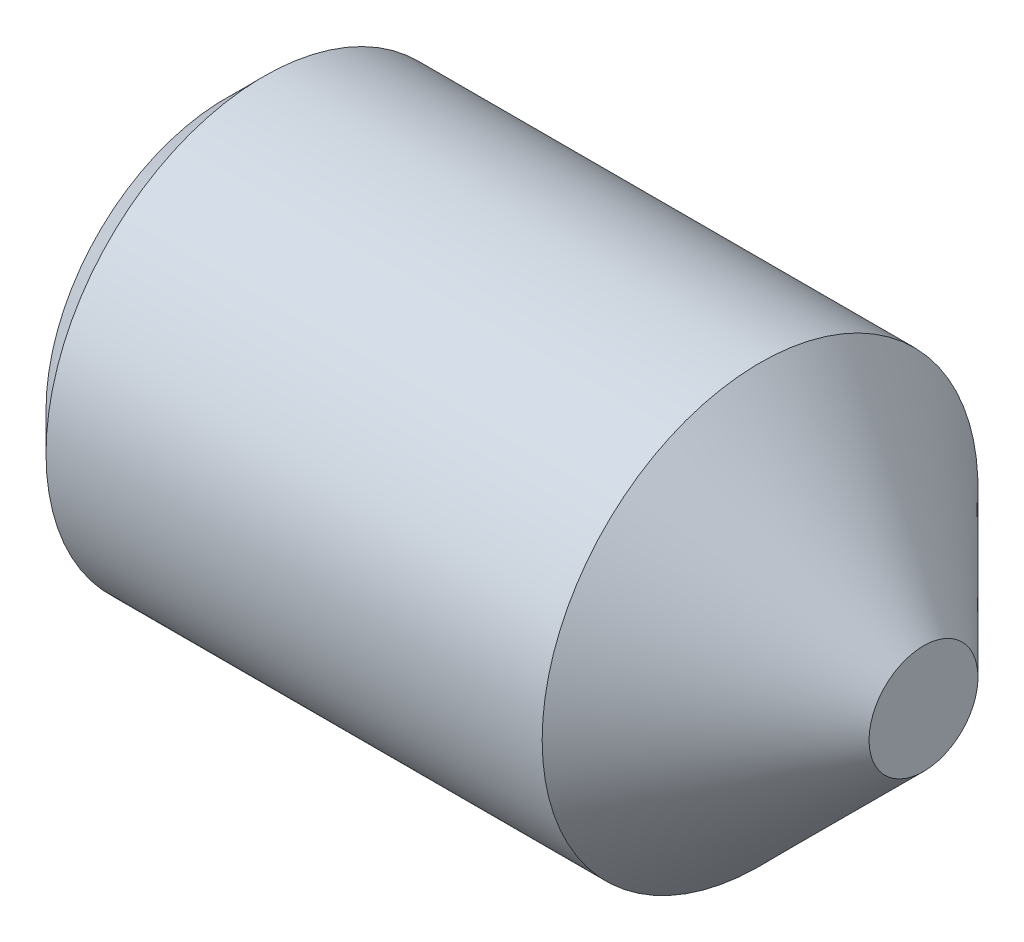
ISO-10303-21;
HEADER;
FILE_DESCRIPTION(('STEP AP214'),'2;1');
FILE_NAME('part.step','',(''),(''),'','','');
FILE_SCHEMA(('AUTOMOTIVE_DESIGN { 1 0 10303 214 1 1 1 1 }'));
ENDSEC;
DATA;
#1=APPLICATION_CONTEXT('core data for automotive mechanical design processes');
#2=APPLICATION_PROTOCOL_DEFINITION('international standard','automotive_design',2000,#1);
#3=PRODUCT_CONTEXT('',#1,'mechanical');
#4=PRODUCT('Part','Part','',(#3));
#5=PRODUCT_RELATED_PRODUCT_CATEGORY('part','',(#4));
#6=PRODUCT_DEFINITION_FORMATION('','',#4);
#7=PRODUCT_DEFINITION_CONTEXT('part definition',#1,'design');
#8=PRODUCT_DEFINITION('design','',#6,#7);
#9=PRODUCT_DEFINITION_SHAPE('','',#8);
#10=(LENGTH_UNIT() NAMED_UNIT(*) SI_UNIT(.MILLI.,.METRE.));
#11=(NAMED_UNIT(*) PLANE_ANGLE_UNIT() SI_UNIT($,.RADIAN.));
#12=(NAMED_UNIT(*) SI_UNIT($,.STERADIAN.) SOLID_ANGLE_UNIT());
#13=UNCERTAINTY_MEASURE_WITH_UNIT(LENGTH_MEASURE(1.E-05),#10,'distance_accuracy_value','');
#14=(GEOMETRIC_REPRESENTATION_CONTEXT(3) GLOBAL_UNCERTAINTY_ASSIGNED_CONTEXT((#13)) GLOBAL_UNIT_ASSIGNED_CONTEXT((#10,
#11,#12)) REPRESENTATION_CONTEXT('',''));
#15=CARTESIAN_POINT('',(0.,0.,0.));
#16=DIRECTION('',(0.,0.,1.));
#17=DIRECTION('',(1.,0.,0.));
#18=AXIS2_PLACEMENT_3D('',#15,#16,#17);
#19=CARTESIAN_POINT('',(1.99999999988631,0.,1.44337567297407));
#20=DIRECTION('',(-1.,0.,0.));
#21=DIRECTION('',(0.,0.,1.));
#22=AXIS2_PLACEMENT_3D('',#19,#20,#21);
#23=PLANE('',#22);
#24=DIRECTION('',(0.,0.,-1.));
#25=VECTOR('',#24,1.);
#26=CARTESIAN_POINT('',(1.99999999988631,1.25,0.721687836487032));
#27=LINE('',#26,#25);
#28=CARTESIAN_POINT('',(1.99999999988631,1.25,0.721687836487032));
#29=VERTEX_POINT('',#28);
#30=CARTESIAN_POINT('',(1.99999999988631,1.25,0.));
#31=VERTEX_POINT('',#30);
#32=EDGE_CURVE('E159',#29,#31,#27,.T.);
#33=ORIENTED_EDGE('',*,*,#32,.T.);
#34=CARTESIAN_POINT('',(1.99999999988631,0.,0.));
#35=DIRECTION('',(1.,0.,0.));
#36=DIRECTION('',(0.,1.,0.));
#37=AXIS2_PLACEMENT_3D('',#34,#35,#36);
#38=CIRCLE('',#37,1.25);
#39=CARTESIAN_POINT('',(1.99999999988631,0.625000000000001,1.08253175473055));
#40=VERTEX_POINT('',#39);
#41=EDGE_CURVE('E48',#31,#40,#38,.T.);
#42=ORIENTED_EDGE('',*,*,#41,.T.);
#43=DIRECTION('',(0.,0.866025403784438,-0.500000000000001));
#44=VECTOR('',#43,1.);
#45=CARTESIAN_POINT('',(1.99999999988631,0.,1.44337567297407));
#46=LINE('',#45,#44);
#47=EDGE_CURVE('E215',#40,#29,#46,.T.);
#48=ORIENTED_EDGE('',*,*,#47,.T.);
#49=EDGE_LOOP('',(#33,#42,#48));
#50=FACE_BOUND('',#49,.T.);
#51=ADVANCED_FACE('F37',(#50),#23,.T.);
#52=CARTESIAN_POINT('',(1.99999999988631,0.,1.44337567297407));
#53=VERTEX_POINT('',#52);
#54=EDGE_CURVE('E220',#53,#40,#46,.T.);
#55=ORIENTED_EDGE('',*,*,#54,.T.);
#56=CARTESIAN_POINT('',(1.99999999988631,-0.625,1.08253175473055));
#57=VERTEX_POINT('',#56);
#58=EDGE_CURVE('E11',#40,#57,#38,.T.);
#59=ORIENTED_EDGE('',*,*,#58,.T.);
#60=DIRECTION('',(0.,0.866025403784438,0.5));
#61=VECTOR('',#60,1.);
#62=CARTESIAN_POINT('',(1.99999999988631,-1.25,0.721687836487033));
#63=LINE('',#62,#61);
#64=EDGE_CURVE('E185',#57,#53,#63,.T.);
#65=ORIENTED_EDGE('',*,*,#64,.T.);
#66=EDGE_LOOP('',(#55,#59,#65));
#67=FACE_BOUND('',#66,.T.);
#68=ADVANCED_FACE('F124',(#67),#23,.T.);
#69=CARTESIAN_POINT('',(1.99999999988631,-1.25,0.721687836487033));
#70=VERTEX_POINT('',#69);
#71=EDGE_CURVE('E221',#70,#57,#63,.T.);
#72=ORIENTED_EDGE('',*,*,#71,.T.);
#73=CARTESIAN_POINT('',(1.99999999988631,-1.25,0.));
#74=VERTEX_POINT('',#73);
#75=EDGE_CURVE('E46',#57,#74,#38,.T.);
#76=ORIENTED_EDGE('',*,*,#75,.T.);
#77=DIRECTION('',(0.,0.,1.));
#78=VECTOR('',#77,1.);
#79=CARTESIAN_POINT('',(1.99999999988631,-1.25,-0.721687836487032));
#80=LINE('',#79,#78);
#81=EDGE_CURVE('E164',#74,#70,#80,.T.);
#82=ORIENTED_EDGE('',*,*,#81,.T.);
#83=EDGE_LOOP('',(#72,#76,#82));
#84=FACE_BOUND('',#83,.T.);
#85=ADVANCED_FACE('F130',(#84),#23,.T.);
#86=CARTESIAN_POINT('',(1.99999999988631,-1.25,-0.721687836487032));
#87=VERTEX_POINT('',#86);
#88=EDGE_CURVE('E165',#87,#74,#80,.T.);
#89=ORIENTED_EDGE('',*,*,#88,.T.);
#90=CARTESIAN_POINT('',(1.99999999988631,-0.625,-1.08253175473055));
#91=VERTEX_POINT('',#90);
#92=EDGE_CURVE('E212',#74,#91,#38,.T.);
#93=ORIENTED_EDGE('',*,*,#92,.T.);
#94=DIRECTION('',(0.,-0.866025403784439,0.5));
#95=VECTOR('',#94,1.);
#96=CARTESIAN_POINT('',(1.99999999988631,0.,-1.44337567297406));
#97=LINE('',#96,#95);
#98=EDGE_CURVE('E154',#91,#87,#97,.T.);
#99=ORIENTED_EDGE('',*,*,#98,.T.);
#100=EDGE_LOOP('',(#89,#93,#99));
#101=FACE_BOUND('',#100,.T.);
#102=ADVANCED_FACE('F143',(#101),#23,.T.);
#103=CARTESIAN_POINT('',(1.99999999988631,0.,-1.44337567297406));
#104=VERTEX_POINT('',#103);
#105=EDGE_CURVE('E157',#104,#91,#97,.T.);
#106=ORIENTED_EDGE('',*,*,#105,.T.);
#107=CARTESIAN_POINT('',(1.99999999988631,0.625,-1.08253175473055));
#108=VERTEX_POINT('',#107);
#109=EDGE_CURVE('E210',#91,#108,#38,.T.);
#110=ORIENTED_EDGE('',*,*,#109,.T.);
#111=DIRECTION('',(0.,-0.866025403784439,-0.5));
#112=VECTOR('',#111,1.);
#113=CARTESIAN_POINT('',(1.99999999988631,1.25,-0.721687836487032));
#114=LINE('',#113,#112);
#115=EDGE_CURVE('E155',#108,#104,#114,.T.);
#116=ORIENTED_EDGE('',*,*,#115,.T.);
#117=EDGE_LOOP('',(#106,#110,#116));
#118=FACE_BOUND('',#117,.T.);
#119=ADVANCED_FACE('F135',(#118),#23,.T.);
#120=CARTESIAN_POINT('',(1.99999999988631,1.25,-0.721687836487032));
#121=VERTEX_POINT('',#120);
#122=EDGE_CURVE('E147',#121,#108,#114,.T.);
#123=ORIENTED_EDGE('',*,*,#122,.T.);
#124=EDGE_CURVE('E148',#108,#31,#38,.T.);
#125=ORIENTED_EDGE('',*,*,#124,.T.);
#126=EDGE_CURVE('E150',#31,#121,#27,.T.);
#127=ORIENTED_EDGE('',*,*,#126,.T.);
#128=EDGE_LOOP('',(#123,#125,#127));
#129=FACE_BOUND('',#128,.T.);
#130=ADVANCED_FACE('F126',(#129),#23,.T.);
#131=CARTESIAN_POINT('',(0.,2.067,0.));
#132=DIRECTION('',(1.,0.,0.));
#133=DIRECTION('',(0.,0.,-1.));
#134=AXIS2_PLACEMENT_3D('',#131,#132,#133);
#135=PLANE('',#134);
#136=DIRECTION('',(0.,0.866025403784438,-0.500000000000001));
#137=VECTOR('',#136,1.);
#138=CARTESIAN_POINT('',(-1.13686837721616E-10,0.,1.44337567297407));
#139=LINE('',#138,#137);
#140=CARTESIAN_POINT('',(0.,0.,1.44337567297407));
#141=VERTEX_POINT('',#140);
#142=CARTESIAN_POINT('',(-1.13686837721616E-10,1.25,0.721687836487032));
#143=VERTEX_POINT('',#142);
#144=EDGE_CURVE('E170',#141,#143,#139,.T.);
#145=ORIENTED_EDGE('',*,*,#144,.F.);
#146=DIRECTION('',(0.,0.866025403784438,0.5));
#147=VECTOR('',#146,1.);
#148=CARTESIAN_POINT('',(-1.13686837721616E-10,-1.25,0.721687836487033));
#149=LINE('',#148,#147);
#150=CARTESIAN_POINT('',(-1.13686837721616E-10,-1.25,0.721687836487033));
#151=VERTEX_POINT('',#150);
#152=EDGE_CURVE('E62',#151,#141,#149,.T.);
#153=ORIENTED_EDGE('',*,*,#152,.F.);
#154=DIRECTION('',(0.,0.,1.));
#155=VECTOR('',#154,1.);
#156=CARTESIAN_POINT('',(-1.13686837721616E-10,-1.25,-0.721687836487032));
#157=LINE('',#156,#155);
#158=CARTESIAN_POINT('',(-1.13686837721616E-10,-1.25,-0.721687836487032));
#159=VERTEX_POINT('',#158);
#160=EDGE_CURVE('E182',#159,#151,#157,.T.);
#161=ORIENTED_EDGE('',*,*,#160,.F.);
#162=DIRECTION('',(0.,-0.866025403784439,0.5));
#163=VECTOR('',#162,1.);
#164=CARTESIAN_POINT('',(-1.13686837721616E-10,0.,-1.44337567297406));
#165=LINE('',#164,#163);
#166=CARTESIAN_POINT('',(-1.13686837721616E-10,0.,-1.44337567297406));
#167=VERTEX_POINT('',#166);
#168=EDGE_CURVE('E179',#167,#159,#165,.T.);
#169=ORIENTED_EDGE('',*,*,#168,.F.);
#170=DIRECTION('',(0.,-0.866025403784439,-0.5));
#171=VECTOR('',#170,1.);
#172=CARTESIAN_POINT('',(-1.13686837721616E-10,1.25,-0.721687836487032));
#173=LINE('',#172,#171);
#174=CARTESIAN_POINT('',(-1.13686837721616E-10,1.25,-0.721687836487032));
#175=VERTEX_POINT('',#174);
#176=EDGE_CURVE('E176',#175,#167,#173,.T.);
#177=ORIENTED_EDGE('',*,*,#176,.F.);
#178=DIRECTION('',(0.,0.,-1.));
#179=VECTOR('',#178,1.);
#180=CARTESIAN_POINT('',(-1.13686837721616E-10,1.25,0.721687836487032));
#181=LINE('',#180,#179);
#182=EDGE_CURVE('E173',#143,#175,#181,.T.);
#183=ORIENTED_EDGE('',*,*,#182,.F.);
#184=EDGE_LOOP('',(#145,#153,#161,#169,#177,#183));
#185=FACE_BOUND('',#184,.T.);
#186=CARTESIAN_POINT('',(0.,0.,0.));
#187=DIRECTION('',(-1.,0.,0.));
#188=DIRECTION('',(0.,0.,1.));
#189=AXIS2_PLACEMENT_3D('',#186,#187,#188);
#190=CIRCLE('',#189,2.067);
#191=CARTESIAN_POINT('',(0.,0.,2.067));
#192=VERTEX_POINT('',#191);
#193=EDGE_CURVE('E188',#192,#192,#190,.T.);
#194=ORIENTED_EDGE('',*,*,#193,.T.);
#195=EDGE_LOOP('',(#194));
#196=FACE_BOUND('',#195,.T.);
#197=ADVANCED_FACE('F39',(#185,#196),#135,.F.);
#198=CARTESIAN_POINT('',(8.,0.,0.));
#199=DIRECTION('',(-1.,0.,0.));
#200=DIRECTION('',(0.,0.,1.));
#201=AXIS2_PLACEMENT_3D('',#198,#199,#200);
#202=PLANE('',#201);
#203=CARTESIAN_POINT('',(8.,0.,0.));
#204=DIRECTION('',(-1.,0.,0.));
#205=DIRECTION('',(0.,0.,1.));
#206=AXIS2_PLACEMENT_3D('',#203,#204,#205);
#207=CIRCLE('',#206,0.625);
#208=CARTESIAN_POINT('',(8.,0.,0.625));
#209=VERTEX_POINT('',#208);
#210=EDGE_CURVE('E41',#209,#209,#207,.T.);
#211=ORIENTED_EDGE('',*,*,#210,.F.);
#212=EDGE_LOOP('',(#211));
#213=FACE_BOUND('',#212,.T.);
#214=ADVANCED_FACE('F141',(#213),#202,.F.);
#215=CARTESIAN_POINT('',(8.,0.,0.));
#216=DIRECTION('',(-1.,0.,0.));
#217=DIRECTION('',(0.,0.,1.));
#218=AXIS2_PLACEMENT_3D('',#215,#216,#217);
#219=CONICAL_SURFACE('',#218,0.625,0.785398163397442);
#220=CARTESIAN_POINT('',(6.12499999999998,0.,0.));
#221=DIRECTION('',(-1.,0.,0.));
#222=DIRECTION('',(0.,0.,1.));
#223=AXIS2_PLACEMENT_3D('',#220,#221,#222);
#224=CIRCLE('',#223,2.5);
#225=CARTESIAN_POINT('',(6.12499999999998,0.,2.5));
#226=VERTEX_POINT('',#225);
#227=EDGE_CURVE('E203',#226,#226,#224,.T.);
#228=ORIENTED_EDGE('',*,*,#227,.F.);
#229=EDGE_LOOP('',(#228));
#230=FACE_BOUND('',#229,.T.);
#231=ORIENTED_EDGE('',*,*,#210,.T.);
#232=EDGE_LOOP('',(#231));
#233=FACE_BOUND('',#232,.T.);
#234=ADVANCED_FACE('F268',(#230,#233),#219,.T.);
#235=CARTESIAN_POINT('',(-14.774129749189,0.,0.));
#236=DIRECTION('',(-1.,0.,0.));
#237=DIRECTION('',(0.,0.,1.));
#238=AXIS2_PLACEMENT_3D('',#235,#236,#237);
#239=CYLINDRICAL_SURFACE('',#238,2.5);
#240=CARTESIAN_POINT('',(0.433000000000003,0.,0.));
#241=DIRECTION('',(-1.,0.,0.));
#242=DIRECTION('',(0.,0.,1.));
#243=AXIS2_PLACEMENT_3D('',#240,#241,#242);
#244=CIRCLE('',#243,2.5);
#245=CARTESIAN_POINT('',(0.433000000000003,0.,2.5));
#246=VERTEX_POINT('',#245);
#247=EDGE_CURVE('E201',#246,#246,#244,.T.);
#248=ORIENTED_EDGE('',*,*,#247,.F.);
#249=EDGE_LOOP('',(#248));
#250=FACE_BOUND('',#249,.T.);
#251=ORIENTED_EDGE('',*,*,#227,.T.);
#252=EDGE_LOOP('',(#251));
#253=FACE_BOUND('',#252,.T.);
#254=ADVANCED_FACE('F264',(#250,#253),#239,.T.);
#255=CARTESIAN_POINT('',(0.433000000000003,0.,0.));
#256=DIRECTION('',(1.,0.,0.));
#257=DIRECTION('',(0.,0.,-1.));
#258=AXIS2_PLACEMENT_3D('',#255,#256,#257);
#259=CONICAL_SURFACE('',#258,2.5,0.785398163397444);
#260=ORIENTED_EDGE('',*,*,#193,.F.);
#261=EDGE_LOOP('',(#260));
#262=FACE_BOUND('',#261,.T.);
#263=ORIENTED_EDGE('',*,*,#247,.T.);
#264=EDGE_LOOP('',(#263));
#265=FACE_BOUND('',#264,.T.);
#266=ADVANCED_FACE('F255',(#262,#265),#259,.T.);
#267=CARTESIAN_POINT('',(1.99999999988631,-1.25,0.721687836487033));
#268=DIRECTION('',(0.,-0.5,0.866025403784439));
#269=DIRECTION('',(0.,-0.866025403784438,-0.5));
#270=AXIS2_PLACEMENT_3D('',#267,#268,#269);
#271=PLANE('',#270);
#272=ORIENTED_EDGE('',*,*,#152,.T.);
#273=DIRECTION('',(-1.,0.,0.));
#274=VECTOR('',#273,1.);
#275=CARTESIAN_POINT('',(1.99999999988631,0.,1.44337567297407));
#276=LINE('',#275,#274);
#277=EDGE_CURVE('E168',#53,#141,#276,.T.);
#278=ORIENTED_EDGE('',*,*,#277,.F.);
#279=ORIENTED_EDGE('',*,*,#64,.F.);
#280=ORIENTED_EDGE('',*,*,#71,.F.);
#281=DIRECTION('',(-1.,0.,0.));
#282=VECTOR('',#281,1.);
#283=CARTESIAN_POINT('',(1.99999999988631,-1.25,0.721687836487033));
#284=LINE('',#283,#282);
#285=EDGE_CURVE('E186',#70,#151,#284,.T.);
#286=ORIENTED_EDGE('',*,*,#285,.T.);
#287=EDGE_LOOP('',(#272,#278,#279,#280,#286));
#288=FACE_BOUND('',#287,.T.);
#289=ADVANCED_FACE('F229',(#288),#271,.F.);
#290=CARTESIAN_POINT('',(1.99999999988631,-1.25,-0.721687836487032));
#291=DIRECTION('',(0.,-1.,0.));
#292=DIRECTION('',(0.,0.,-1.));
#293=AXIS2_PLACEMENT_3D('',#290,#291,#292);
#294=PLANE('',#293);
#295=ORIENTED_EDGE('',*,*,#160,.T.);
#296=ORIENTED_EDGE('',*,*,#285,.F.);
#297=ORIENTED_EDGE('',*,*,#81,.F.);
#298=ORIENTED_EDGE('',*,*,#88,.F.);
#299=DIRECTION('',(-1.,0.,0.));
#300=VECTOR('',#299,1.);
#301=CARTESIAN_POINT('',(1.99999999988631,-1.25,-0.721687836487032));
#302=LINE('',#301,#300);
#303=EDGE_CURVE('E189',#87,#159,#302,.T.);
#304=ORIENTED_EDGE('',*,*,#303,.T.);
#305=EDGE_LOOP('',(#295,#296,#297,#298,#304));
#306=FACE_BOUND('',#305,.T.);
#307=ADVANCED_FACE('F248',(#306),#294,.F.);
#308=CARTESIAN_POINT('',(1.99999999988631,0.,-1.44337567297406));
#309=DIRECTION('',(0.,-0.5,-0.866025403784439));
#310=DIRECTION('',(0.,0.866025403784439,-0.5));
#311=AXIS2_PLACEMENT_3D('',#308,#309,#310);
#312=PLANE('',#311);
#313=ORIENTED_EDGE('',*,*,#168,.T.);
#314=ORIENTED_EDGE('',*,*,#303,.F.);
#315=ORIENTED_EDGE('',*,*,#98,.F.);
#316=ORIENTED_EDGE('',*,*,#105,.F.);
#317=DIRECTION('',(-1.,0.,0.));
#318=VECTOR('',#317,1.);
#319=CARTESIAN_POINT('',(1.99999999988631,0.,-1.44337567297406));
#320=LINE('',#319,#318);
#321=EDGE_CURVE('E191',#104,#167,#320,.T.);
#322=ORIENTED_EDGE('',*,*,#321,.T.);
#323=EDGE_LOOP('',(#313,#314,#315,#316,#322));
#324=FACE_BOUND('',#323,.T.);
#325=ADVANCED_FACE('F242',(#324),#312,.F.);
#326=CARTESIAN_POINT('',(1.99999999988631,1.25,-0.721687836487032));
#327=DIRECTION('',(0.,0.5,-0.866025403784439));
#328=DIRECTION('',(0.,0.866025403784439,0.5));
#329=AXIS2_PLACEMENT_3D('',#326,#327,#328);
#330=PLANE('',#329);
#331=ORIENTED_EDGE('',*,*,#176,.T.);
#332=ORIENTED_EDGE('',*,*,#321,.F.);
#333=ORIENTED_EDGE('',*,*,#115,.F.);
#334=ORIENTED_EDGE('',*,*,#122,.F.);
#335=DIRECTION('',(-1.,0.,0.));
#336=VECTOR('',#335,1.);
#337=CARTESIAN_POINT('',(1.99999999988631,1.25,-0.721687836487032));
#338=LINE('',#337,#336);
#339=EDGE_CURVE('E193',#121,#175,#338,.T.);
#340=ORIENTED_EDGE('',*,*,#339,.T.);
#341=EDGE_LOOP('',(#331,#332,#333,#334,#340));
#342=FACE_BOUND('',#341,.T.);
#343=ADVANCED_FACE('F237',(#342),#330,.F.);
#344=CARTESIAN_POINT('',(1.99999999988631,1.25,0.721687836487032));
#345=DIRECTION('',(0.,1.,0.));
#346=DIRECTION('',(0.,0.,1.));
#347=AXIS2_PLACEMENT_3D('',#344,#345,#346);
#348=PLANE('',#347);
#349=ORIENTED_EDGE('',*,*,#182,.T.);
#350=ORIENTED_EDGE('',*,*,#339,.F.);
#351=ORIENTED_EDGE('',*,*,#126,.F.);
#352=ORIENTED_EDGE('',*,*,#32,.F.);
#353=DIRECTION('',(-1.,0.,0.));
#354=VECTOR('',#353,1.);
#355=CARTESIAN_POINT('',(1.99999999988631,1.25,0.721687836487032));
#356=LINE('',#355,#354);
#357=EDGE_CURVE('E195',#29,#143,#356,.T.);
#358=ORIENTED_EDGE('',*,*,#357,.T.);
#359=EDGE_LOOP('',(#349,#350,#351,#352,#358));
#360=FACE_BOUND('',#359,.T.);
#361=ADVANCED_FACE('F119',(#360),#348,.F.);
#362=CARTESIAN_POINT('',(1.99999999988631,0.,1.44337567297407));
#363=DIRECTION('',(0.,0.500000000000001,0.866025403784438));
#364=DIRECTION('',(0.,-0.866025403784438,0.500000000000001));
#365=AXIS2_PLACEMENT_3D('',#362,#363,#364);
#366=PLANE('',#365);
#367=ORIENTED_EDGE('',*,*,#144,.T.);
#368=ORIENTED_EDGE('',*,*,#357,.F.);
#369=ORIENTED_EDGE('',*,*,#47,.F.);
#370=ORIENTED_EDGE('',*,*,#54,.F.);
#371=ORIENTED_EDGE('',*,*,#277,.T.);
#372=EDGE_LOOP('',(#367,#368,#369,#370,#371));
#373=FACE_BOUND('',#372,.T.);
#374=ADVANCED_FACE('F114',(#373),#366,.F.);
#375=CARTESIAN_POINT('',(2.72168783637335,0.,0.));
#376=DIRECTION('',(-1.,0.,0.));
#377=DIRECTION('',(0.,-1.,0.));
#378=AXIS2_PLACEMENT_3D('',#375,#376,#377);
#379=CONICAL_SURFACE('',#378,0.,1.0471975511966);
#380=ORIENTED_EDGE('',*,*,#41,.F.);
#381=ORIENTED_EDGE('',*,*,#124,.F.);
#382=ORIENTED_EDGE('',*,*,#109,.F.);
#383=ORIENTED_EDGE('',*,*,#92,.F.);
#384=ORIENTED_EDGE('',*,*,#75,.F.);
#385=ORIENTED_EDGE('',*,*,#58,.F.);
#386=EDGE_LOOP('',(#380,#381,#382,#383,#384,#385));
#387=FACE_BOUND('',#386,.T.);
#388=CARTESIAN_POINT('',(2.72168783637335,0.,0.));
#389=VERTEX_POINT('',#388);
#390=VERTEX_LOOP('',#389);
#391=FACE_BOUND('',#390,.T.);
#392=ADVANCED_FACE('F112',(#387,#391),#379,.F.);
#393=CLOSED_SHELL('',(#51,#68,#85,#102,#119,#130,#197,#214,#234,#254,#266,#289,#307,#325,#343,
#361,#374,#392));
#394=MANIFOLD_SOLID_BREP('B2',#393);
#395=ADVANCED_BREP_SHAPE_REPRESENTATION('',(#18,#394),#14);
#396=SHAPE_DEFINITION_REPRESENTATION(#9,#395);
ENDSEC;
END-ISO-10303-21;
